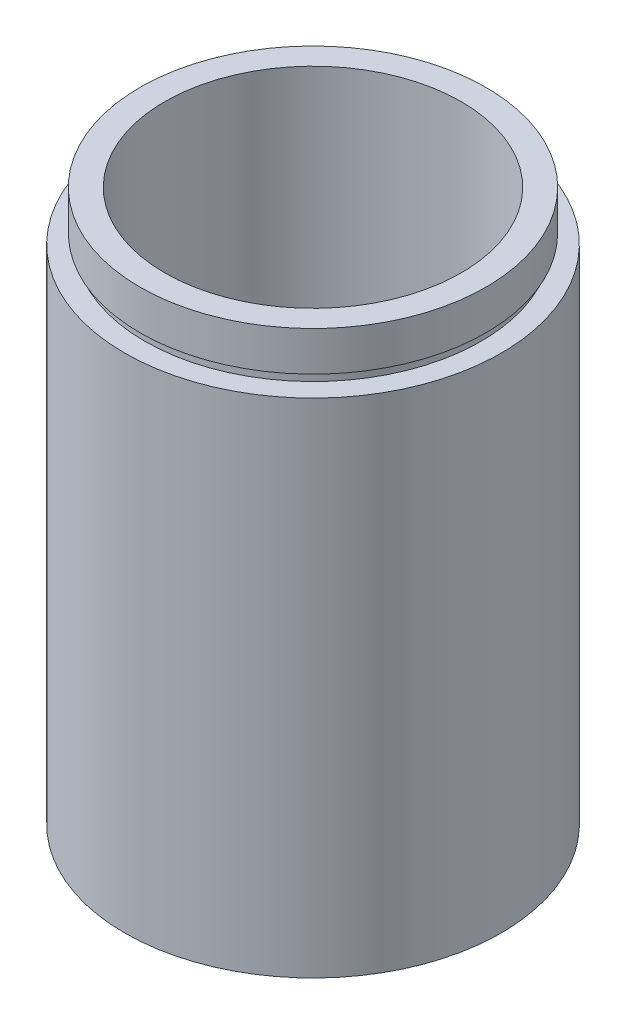
ISO-10303-21;
HEADER;
FILE_DESCRIPTION(('STEP AP214'),'2;1');
FILE_NAME('part.step','',(''),(''),'','','');
FILE_SCHEMA(('AUTOMOTIVE_DESIGN { 1 0 10303 214 1 1 1 1 }'));
ENDSEC;
DATA;
#1=APPLICATION_CONTEXT('core data for automotive mechanical design processes');
#2=APPLICATION_PROTOCOL_DEFINITION('international standard','automotive_design',2000,#1);
#3=PRODUCT_CONTEXT('',#1,'mechanical');
#4=PRODUCT('Part','Part','',(#3));
#5=PRODUCT_RELATED_PRODUCT_CATEGORY('part','',(#4));
#6=PRODUCT_DEFINITION_FORMATION('','',#4);
#7=PRODUCT_DEFINITION_CONTEXT('part definition',#1,'design');
#8=PRODUCT_DEFINITION('design','',#6,#7);
#9=PRODUCT_DEFINITION_SHAPE('','',#8);
#10=(LENGTH_UNIT() NAMED_UNIT(*) SI_UNIT(.MILLI.,.METRE.));
#11=(NAMED_UNIT(*) PLANE_ANGLE_UNIT() SI_UNIT($,.RADIAN.));
#12=(NAMED_UNIT(*) SI_UNIT($,.STERADIAN.) SOLID_ANGLE_UNIT());
#13=UNCERTAINTY_MEASURE_WITH_UNIT(LENGTH_MEASURE(1.E-05),#10,'distance_accuracy_value','');
#14=(GEOMETRIC_REPRESENTATION_CONTEXT(3) GLOBAL_UNCERTAINTY_ASSIGNED_CONTEXT((#13)) GLOBAL_UNIT_ASSIGNED_CONTEXT((#10,
#11,#12)) REPRESENTATION_CONTEXT('',''));
#15=CARTESIAN_POINT('',(0.,0.,0.));
#16=DIRECTION('',(0.,0.,1.));
#17=DIRECTION('',(1.,0.,0.));
#18=AXIS2_PLACEMENT_3D('',#15,#16,#17);
#19=CARTESIAN_POINT('',(17.,0.,0.));
#20=DIRECTION('',(0.,1.,0.));
#21=DIRECTION('',(0.,0.,1.));
#22=AXIS2_PLACEMENT_3D('',#19,#20,#21);
#23=PLANE('',#22);
#24=CARTESIAN_POINT('',(0.,0.,0.));
#25=DIRECTION('',(0.,1.,0.));
#26=DIRECTION('',(0.,0.,1.));
#27=AXIS2_PLACEMENT_3D('',#24,#25,#26);
#28=CIRCLE('',#27,19.05);
#29=CARTESIAN_POINT('',(0.,0.,19.05));
#30=VERTEX_POINT('',#29);
#31=EDGE_CURVE('E10',#30,#30,#28,.T.);
#32=ORIENTED_EDGE('',*,*,#31,.F.);
#33=EDGE_LOOP('',(#32));
#34=FACE_BOUND('',#33,.T.);
#35=CARTESIAN_POINT('',(0.,0.,0.));
#36=DIRECTION('',(0.,1.,0.));
#37=DIRECTION('',(0.,0.,1.));
#38=AXIS2_PLACEMENT_3D('',#35,#36,#37);
#39=CIRCLE('',#38,17.);
#40=CARTESIAN_POINT('',(0.,0.,17.));
#41=VERTEX_POINT('',#40);
#42=EDGE_CURVE('E77',#41,#41,#39,.T.);
#43=ORIENTED_EDGE('',*,*,#42,.T.);
#44=EDGE_LOOP('',(#43));
#45=FACE_BOUND('',#44,.T.);
#46=ADVANCED_FACE('F37',(#34,#45),#23,.F.);
#47=CARTESIAN_POINT('',(0.,161.376166943427,0.));
#48=DIRECTION('',(0.,1.,0.));
#49=DIRECTION('',(0.,0.,1.));
#50=AXIS2_PLACEMENT_3D('',#47,#48,#49);
#51=CYLINDRICAL_SURFACE('',#50,19.05);
#52=CARTESIAN_POINT('',(0.,50.8,0.));
#53=DIRECTION('',(0.,1.,0.));
#54=DIRECTION('',(0.,0.,1.));
#55=AXIS2_PLACEMENT_3D('',#52,#53,#54);
#56=CIRCLE('',#55,19.05);
#57=CARTESIAN_POINT('',(0.,50.8,19.05));
#58=VERTEX_POINT('',#57);
#59=EDGE_CURVE('E43',#58,#58,#56,.T.);
#60=ORIENTED_EDGE('',*,*,#59,.F.);
#61=EDGE_LOOP('',(#60));
#62=FACE_BOUND('',#61,.T.);
#63=ORIENTED_EDGE('',*,*,#31,.T.);
#64=EDGE_LOOP('',(#63));
#65=FACE_BOUND('',#64,.T.);
#66=ADVANCED_FACE('F138',(#62,#65),#51,.T.);
#67=CARTESIAN_POINT('',(19.05,50.8,0.));
#68=DIRECTION('',(0.,-1.,0.));
#69=DIRECTION('',(0.,0.,-1.));
#70=AXIS2_PLACEMENT_3D('',#67,#68,#69);
#71=PLANE('',#70);
#72=CARTESIAN_POINT('',(0.,50.8,0.));
#73=DIRECTION('',(0.,1.,0.));
#74=DIRECTION('',(0.,0.,1.));
#75=AXIS2_PLACEMENT_3D('',#72,#73,#74);
#76=CIRCLE('',#75,17.);
#77=CARTESIAN_POINT('',(0.,50.8,17.));
#78=VERTEX_POINT('',#77);
#79=EDGE_CURVE('E47',#78,#78,#76,.T.);
#80=ORIENTED_EDGE('',*,*,#79,.F.);
#81=EDGE_LOOP('',(#80));
#82=FACE_BOUND('',#81,.T.);
#83=ORIENTED_EDGE('',*,*,#59,.T.);
#84=EDGE_LOOP('',(#83));
#85=FACE_BOUND('',#84,.T.);
#86=ADVANCED_FACE('F133',(#82,#85),#71,.F.);
#87=CARTESIAN_POINT('',(0.,161.376166943427,0.));
#88=DIRECTION('',(0.,1.,0.));
#89=DIRECTION('',(0.,0.,1.));
#90=AXIS2_PLACEMENT_3D('',#87,#88,#89);
#91=CYLINDRICAL_SURFACE('',#90,17.);
#92=CARTESIAN_POINT('',(0.,51.8,0.));
#93=DIRECTION('',(0.,1.,0.));
#94=DIRECTION('',(0.,0.,1.));
#95=AXIS2_PLACEMENT_3D('',#92,#93,#94);
#96=CIRCLE('',#95,17.);
#97=CARTESIAN_POINT('',(0.,51.8,17.));
#98=VERTEX_POINT('',#97);
#99=EDGE_CURVE('E51',#98,#98,#96,.T.);
#100=ORIENTED_EDGE('',*,*,#99,.F.);
#101=EDGE_LOOP('',(#100));
#102=FACE_BOUND('',#101,.T.);
#103=ORIENTED_EDGE('',*,*,#79,.T.);
#104=EDGE_LOOP('',(#103));
#105=FACE_BOUND('',#104,.T.);
#106=ADVANCED_FACE('F127',(#102,#105),#91,.T.);
#107=CARTESIAN_POINT('',(17.,51.8,0.));
#108=DIRECTION('',(0.,1.,0.));
#109=DIRECTION('',(0.,0.,1.));
#110=AXIS2_PLACEMENT_3D('',#107,#108,#109);
#111=PLANE('',#110);
#112=CARTESIAN_POINT('',(0.,51.8,0.));
#113=DIRECTION('',(0.,1.,0.));
#114=DIRECTION('',(0.,0.,1.));
#115=AXIS2_PLACEMENT_3D('',#112,#113,#114);
#116=CIRCLE('',#115,17.5);
#117=CARTESIAN_POINT('',(0.,51.8,17.5));
#118=VERTEX_POINT('',#117);
#119=EDGE_CURVE('E56',#118,#118,#116,.T.);
#120=ORIENTED_EDGE('',*,*,#119,.F.);
#121=EDGE_LOOP('',(#120));
#122=FACE_BOUND('',#121,.T.);
#123=ORIENTED_EDGE('',*,*,#99,.T.);
#124=EDGE_LOOP('',(#123));
#125=FACE_BOUND('',#124,.T.);
#126=ADVANCED_FACE('F121',(#122,#125),#111,.F.);
#127=CARTESIAN_POINT('',(0.,161.376166943427,0.));
#128=DIRECTION('',(0.,1.,0.));
#129=DIRECTION('',(0.,0.,1.));
#130=AXIS2_PLACEMENT_3D('',#127,#128,#129);
#131=CYLINDRICAL_SURFACE('',#130,17.5);
#132=CARTESIAN_POINT('',(0.,55.8,0.));
#133=DIRECTION('',(0.,1.,0.));
#134=DIRECTION('',(0.,0.,1.));
#135=AXIS2_PLACEMENT_3D('',#132,#133,#134);
#136=CIRCLE('',#135,17.5);
#137=CARTESIAN_POINT('',(0.,55.8,17.5));
#138=VERTEX_POINT('',#137);
#139=EDGE_CURVE('E59',#138,#138,#136,.T.);
#140=ORIENTED_EDGE('',*,*,#139,.F.);
#141=EDGE_LOOP('',(#140));
#142=FACE_BOUND('',#141,.T.);
#143=ORIENTED_EDGE('',*,*,#119,.T.);
#144=EDGE_LOOP('',(#143));
#145=FACE_BOUND('',#144,.T.);
#146=ADVANCED_FACE('F115',(#142,#145),#131,.T.);
#147=CARTESIAN_POINT('',(17.5,55.8,0.));
#148=DIRECTION('',(0.,-1.,0.));
#149=DIRECTION('',(0.,0.,-1.));
#150=AXIS2_PLACEMENT_3D('',#147,#148,#149);
#151=PLANE('',#150);
#152=CARTESIAN_POINT('',(0.,55.8,0.));
#153=DIRECTION('',(0.,1.,0.));
#154=DIRECTION('',(0.,0.,1.));
#155=AXIS2_PLACEMENT_3D('',#152,#153,#154);
#156=CIRCLE('',#155,15.);
#157=CARTESIAN_POINT('',(0.,55.8,15.));
#158=VERTEX_POINT('',#157);
#159=EDGE_CURVE('E62',#158,#158,#156,.T.);
#160=ORIENTED_EDGE('',*,*,#159,.F.);
#161=EDGE_LOOP('',(#160));
#162=FACE_BOUND('',#161,.T.);
#163=ORIENTED_EDGE('',*,*,#139,.T.);
#164=EDGE_LOOP('',(#163));
#165=FACE_BOUND('',#164,.T.);
#166=ADVANCED_FACE('F109',(#162,#165),#151,.F.);
#167=CARTESIAN_POINT('',(0.,161.376166943427,0.));
#168=DIRECTION('',(0.,1.,0.));
#169=DIRECTION('',(0.,0.,1.));
#170=AXIS2_PLACEMENT_3D('',#167,#168,#169);
#171=CYLINDRICAL_SURFACE('',#170,15.);
#172=CARTESIAN_POINT('',(0.,5.49999999999998,0.));
#173=DIRECTION('',(0.,1.,0.));
#174=DIRECTION('',(0.,0.,1.));
#175=AXIS2_PLACEMENT_3D('',#172,#173,#174);
#176=CIRCLE('',#175,15.);
#177=CARTESIAN_POINT('',(0.,5.49999999999998,15.));
#178=VERTEX_POINT('',#177);
#179=EDGE_CURVE('E65',#178,#178,#176,.T.);
#180=ORIENTED_EDGE('',*,*,#179,.F.);
#181=EDGE_LOOP('',(#180));
#182=FACE_BOUND('',#181,.T.);
#183=ORIENTED_EDGE('',*,*,#159,.T.);
#184=EDGE_LOOP('',(#183));
#185=FACE_BOUND('',#184,.T.);
#186=ADVANCED_FACE('F103',(#182,#185),#171,.F.);
#187=CARTESIAN_POINT('',(17.6,5.49999999999998,0.));
#188=DIRECTION('',(0.,1.,0.));
#189=DIRECTION('',(0.,0.,1.));
#190=AXIS2_PLACEMENT_3D('',#187,#188,#189);
#191=PLANE('',#190);
#192=CARTESIAN_POINT('',(0.,5.49999999999998,0.));
#193=DIRECTION('',(0.,1.,0.));
#194=DIRECTION('',(0.,0.,1.));
#195=AXIS2_PLACEMENT_3D('',#192,#193,#194);
#196=CIRCLE('',#195,17.6);
#197=CARTESIAN_POINT('',(0.,5.49999999999998,17.6));
#198=VERTEX_POINT('',#197);
#199=EDGE_CURVE('E68',#198,#198,#196,.T.);
#200=ORIENTED_EDGE('',*,*,#199,.F.);
#201=EDGE_LOOP('',(#200));
#202=FACE_BOUND('',#201,.T.);
#203=ORIENTED_EDGE('',*,*,#179,.T.);
#204=EDGE_LOOP('',(#203));
#205=FACE_BOUND('',#204,.T.);
#206=ADVANCED_FACE('F97',(#202,#205),#191,.F.);
#207=CARTESIAN_POINT('',(0.,161.376166943427,0.));
#208=DIRECTION('',(0.,1.,0.));
#209=DIRECTION('',(0.,0.,1.));
#210=AXIS2_PLACEMENT_3D('',#207,#208,#209);
#211=CYLINDRICAL_SURFACE('',#210,17.6);
#212=CARTESIAN_POINT('',(0.,4.49999999999998,0.));
#213=DIRECTION('',(0.,1.,0.));
#214=DIRECTION('',(0.,0.,1.));
#215=AXIS2_PLACEMENT_3D('',#212,#213,#214);
#216=CIRCLE('',#215,17.6);
#217=CARTESIAN_POINT('',(0.,4.49999999999998,17.6));
#218=VERTEX_POINT('',#217);
#219=EDGE_CURVE('E71',#218,#218,#216,.T.);
#220=ORIENTED_EDGE('',*,*,#219,.F.);
#221=EDGE_LOOP('',(#220));
#222=FACE_BOUND('',#221,.T.);
#223=ORIENTED_EDGE('',*,*,#199,.T.);
#224=EDGE_LOOP('',(#223));
#225=FACE_BOUND('',#224,.T.);
#226=ADVANCED_FACE('F91',(#222,#225),#211,.F.);
#227=CARTESIAN_POINT('',(17.,4.49999999999998,0.));
#228=DIRECTION('',(0.,-1.,0.));
#229=DIRECTION('',(0.,0.,-1.));
#230=AXIS2_PLACEMENT_3D('',#227,#228,#229);
#231=PLANE('',#230);
#232=CARTESIAN_POINT('',(0.,4.49999999999998,0.));
#233=DIRECTION('',(0.,1.,0.));
#234=DIRECTION('',(0.,0.,1.));
#235=AXIS2_PLACEMENT_3D('',#232,#233,#234);
#236=CIRCLE('',#235,17.);
#237=CARTESIAN_POINT('',(0.,4.49999999999998,17.));
#238=VERTEX_POINT('',#237);
#239=EDGE_CURVE('E74',#238,#238,#236,.T.);
#240=ORIENTED_EDGE('',*,*,#239,.F.);
#241=EDGE_LOOP('',(#240));
#242=FACE_BOUND('',#241,.T.);
#243=ORIENTED_EDGE('',*,*,#219,.T.);
#244=EDGE_LOOP('',(#243));
#245=FACE_BOUND('',#244,.T.);
#246=ADVANCED_FACE('F85',(#242,#245),#231,.F.);
#247=CARTESIAN_POINT('',(0.,161.376166943427,0.));
#248=DIRECTION('',(0.,1.,0.));
#249=DIRECTION('',(0.,0.,1.));
#250=AXIS2_PLACEMENT_3D('',#247,#248,#249);
#251=CYLINDRICAL_SURFACE('',#250,17.);
#252=ORIENTED_EDGE('',*,*,#42,.F.);
#253=EDGE_LOOP('',(#252));
#254=FACE_BOUND('',#253,.T.);
#255=ORIENTED_EDGE('',*,*,#239,.T.);
#256=EDGE_LOOP('',(#255));
#257=FACE_BOUND('',#256,.T.);
#258=ADVANCED_FACE('F82',(#254,#257),#251,.F.);
#259=CLOSED_SHELL('',(#46,#66,#86,#106,#126,#146,#166,#186,#206,#226,#246,#258));
#260=MANIFOLD_SOLID_BREP('B2',#259);
#261=ADVANCED_BREP_SHAPE_REPRESENTATION('',(#18,#260),#14);
#262=SHAPE_DEFINITION_REPRESENTATION(#9,#261);
ENDSEC;
END-ISO-10303-21;
